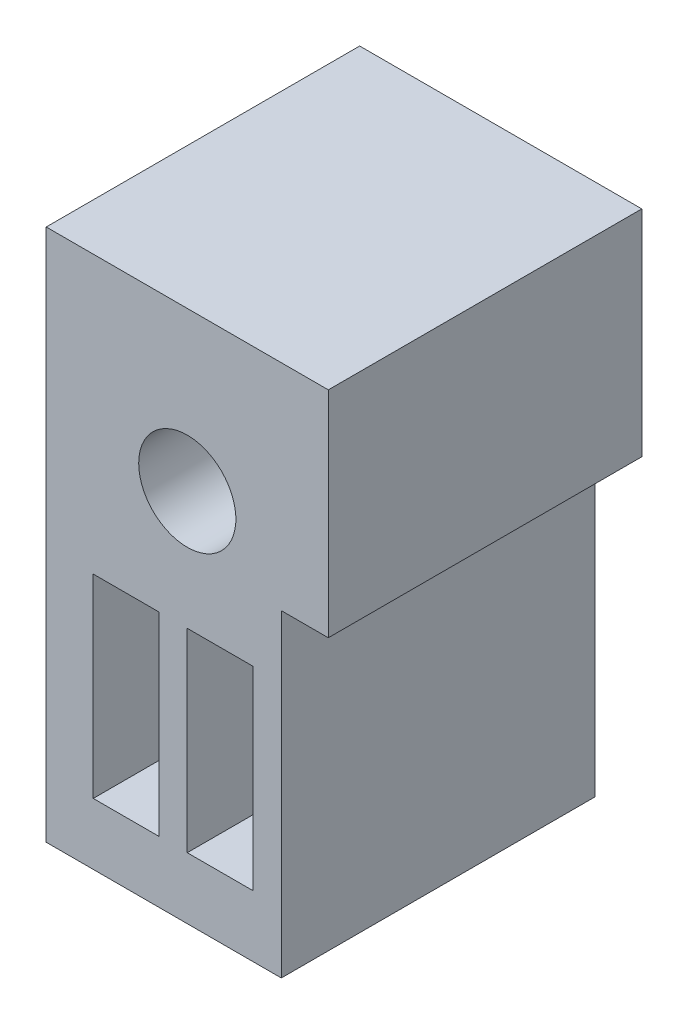
ISO-10303-21;
HEADER;
FILE_DESCRIPTION(('STEP AP214'),'2;1');
FILE_NAME('part.step','',(''),(''),'','','');
FILE_SCHEMA(('AUTOMOTIVE_DESIGN { 1 0 10303 214 1 1 1 1 }'));
ENDSEC;
DATA;
#1=APPLICATION_CONTEXT('core data for automotive mechanical design processes');
#2=APPLICATION_PROTOCOL_DEFINITION('international standard','automotive_design',2000,#1);
#3=PRODUCT_CONTEXT('',#1,'mechanical');
#4=PRODUCT('Part','Part','',(#3));
#5=PRODUCT_RELATED_PRODUCT_CATEGORY('part','',(#4));
#6=PRODUCT_DEFINITION_FORMATION('','',#4);
#7=PRODUCT_DEFINITION_CONTEXT('part definition',#1,'design');
#8=PRODUCT_DEFINITION('design','',#6,#7);
#9=PRODUCT_DEFINITION_SHAPE('','',#8);
#10=(LENGTH_UNIT() NAMED_UNIT(*) SI_UNIT(.MILLI.,.METRE.));
#11=(NAMED_UNIT(*) PLANE_ANGLE_UNIT() SI_UNIT($,.RADIAN.));
#12=(NAMED_UNIT(*) SI_UNIT($,.STERADIAN.) SOLID_ANGLE_UNIT());
#13=UNCERTAINTY_MEASURE_WITH_UNIT(LENGTH_MEASURE(1.E-05),#10,'distance_accuracy_value','');
#14=(GEOMETRIC_REPRESENTATION_CONTEXT(3) GLOBAL_UNCERTAINTY_ASSIGNED_CONTEXT((#13)) GLOBAL_UNIT_ASSIGNED_CONTEXT((#10,
#11,#12)) REPRESENTATION_CONTEXT('',''));
#15=CARTESIAN_POINT('',(0.,0.,0.));
#16=DIRECTION('',(0.,0.,1.));
#17=DIRECTION('',(1.,0.,0.));
#18=AXIS2_PLACEMENT_3D('',#15,#16,#17);
#19=CARTESIAN_POINT('',(0.,0.,-30.1695073311752));
#20=DIRECTION('',(0.,0.,1.));
#21=DIRECTION('',(1.,0.,0.));
#22=AXIS2_PLACEMENT_3D('',#19,#20,#21);
#23=PLANE('',#22);
#24=DIRECTION('',(0.,-1.,0.));
#25=VECTOR('',#24,1.);
#26=CARTESIAN_POINT('',(18.2480610316519,23.3882221671382,-30.1695073311752));
#27=LINE('',#26,#25);
#28=CARTESIAN_POINT('',(18.2480610316519,23.3882221671382,-30.1695073311752));
#29=VERTEX_POINT('',#28);
#30=CARTESIAN_POINT('',(18.2480610316519,17.1882221671382,-30.1695073311752));
#31=VERTEX_POINT('',#30);
#32=EDGE_CURVE('E167',#29,#31,#27,.T.);
#33=ORIENTED_EDGE('',*,*,#32,.F.);
#34=DIRECTION('',(1.,0.,0.));
#35=VECTOR('',#34,1.);
#36=CARTESIAN_POINT('',(16.1480610316519,23.3882221671382,-30.1695073311752));
#37=LINE('',#36,#35);
#38=CARTESIAN_POINT('',(16.1480610316519,23.3882221671382,-30.1695073311752));
#39=VERTEX_POINT('',#38);
#40=EDGE_CURVE('E175',#39,#29,#37,.T.);
#41=ORIENTED_EDGE('',*,*,#40,.F.);
#42=DIRECTION('',(0.,1.,0.));
#43=VECTOR('',#42,1.);
#44=CARTESIAN_POINT('',(16.1480610316519,23.3882221671382,-30.1695073311752));
#45=LINE('',#44,#43);
#46=CARTESIAN_POINT('',(16.1480610316519,17.1882221671382,-30.1695073311752));
#47=VERTEX_POINT('',#46);
#48=EDGE_CURVE('E172',#47,#39,#45,.T.);
#49=ORIENTED_EDGE('',*,*,#48,.F.);
#50=DIRECTION('',(-1.,0.,0.));
#51=VECTOR('',#50,1.);
#52=CARTESIAN_POINT('',(18.2480610316519,17.1882221671382,-30.1695073311752));
#53=LINE('',#52,#51);
#54=EDGE_CURVE('E169',#31,#47,#53,.T.);
#55=ORIENTED_EDGE('',*,*,#54,.F.);
#56=EDGE_LOOP('',(#33,#41,#49,#55));
#57=FACE_BOUND('',#56,.T.);
#58=DIRECTION('',(1.,0.,0.));
#59=VECTOR('',#58,1.);
#60=CARTESIAN_POINT('',(19.1480610316519,32.2269800340669,-30.1695073311752));
#61=LINE('',#60,#59);
#62=CARTESIAN_POINT('',(14.6480610316519,32.2269800340669,-30.1695073311752));
#63=VERTEX_POINT('',#62);
#64=CARTESIAN_POINT('',(23.6480610316519,32.2269800340669,-30.1695073311752));
#65=VERTEX_POINT('',#64);
#66=EDGE_CURVE('E204',#63,#65,#61,.T.);
#67=ORIENTED_EDGE('',*,*,#66,.T.);
#68=DIRECTION('',(0.,-1.,0.));
#69=VECTOR('',#68,1.);
#70=CARTESIAN_POINT('',(23.6480610316519,32.2269800340669,-30.1695073311752));
#71=LINE('',#70,#69);
#72=CARTESIAN_POINT('',(23.6480610316519,25.3772167345225,-30.1695073311752));
#73=VERTEX_POINT('',#72);
#74=EDGE_CURVE('E206',#65,#73,#71,.T.);
#75=ORIENTED_EDGE('',*,*,#74,.T.);
#76=DIRECTION('',(-1.,0.,0.));
#77=VECTOR('',#76,1.);
#78=CARTESIAN_POINT('',(23.6480610316519,25.3772167345225,-30.1695073311752));
#79=LINE('',#78,#77);
#80=CARTESIAN_POINT('',(22.1480610316519,25.3772167345225,-30.1695073311752));
#81=VERTEX_POINT('',#80);
#82=EDGE_CURVE('E209',#73,#81,#79,.T.);
#83=ORIENTED_EDGE('',*,*,#82,.T.);
#84=DIRECTION('',(0.,-1.,0.));
#85=VECTOR('',#84,1.);
#86=CARTESIAN_POINT('',(22.1480610316519,25.3772167345225,-30.1695073311752));
#87=LINE('',#86,#85);
#88=CARTESIAN_POINT('',(22.1480610316519,15.2269800340722,-30.1695073311752));
#89=VERTEX_POINT('',#88);
#90=EDGE_CURVE('E211',#81,#89,#87,.T.);
#91=ORIENTED_EDGE('',*,*,#90,.T.);
#92=DIRECTION('',(-1.,0.,0.));
#93=VECTOR('',#92,1.);
#94=CARTESIAN_POINT('',(22.1480610316519,15.2269800340722,-30.1695073311752));
#95=LINE('',#94,#93);
#96=CARTESIAN_POINT('',(14.6480610316519,15.226980034072,-30.1695073311752));
#97=VERTEX_POINT('',#96);
#98=EDGE_CURVE('E213',#89,#97,#95,.T.);
#99=ORIENTED_EDGE('',*,*,#98,.T.);
#100=DIRECTION('',(0.,1.,0.));
#101=VECTOR('',#100,1.);
#102=CARTESIAN_POINT('',(14.6480610316519,25.377216734525,-30.1695073311752));
#103=LINE('',#102,#101);
#104=EDGE_CURVE('E215',#97,#63,#103,.T.);
#105=ORIENTED_EDGE('',*,*,#104,.T.);
#106=EDGE_LOOP('',(#67,#75,#83,#91,#99,#105));
#107=FACE_BOUND('',#106,.T.);
#108=CARTESIAN_POINT('',(19.1480610316519,27.1767433336178,-30.1695073311752));
#109=DIRECTION('',(0.,0.,-1.));
#110=DIRECTION('',(-1.,0.,0.));
#111=AXIS2_PLACEMENT_3D('',#108,#109,#110);
#112=CIRCLE('',#111,1.55000000000021);
#113=CARTESIAN_POINT('',(17.5980610316517,27.1767433336178,-30.1695073311752));
#114=VERTEX_POINT('',#113);
#115=EDGE_CURVE('E198',#114,#114,#112,.T.);
#116=ORIENTED_EDGE('',*,*,#115,.F.);
#117=EDGE_LOOP('',(#116));
#118=FACE_BOUND('',#117,.T.);
#119=DIRECTION('',(-1.,0.,0.));
#120=VECTOR('',#119,1.);
#121=CARTESIAN_POINT('',(21.2469833029343,17.1882221671376,-30.1695073311752));
#122=LINE('',#121,#120);
#123=CARTESIAN_POINT('',(21.2469833029343,17.1882221671376,-30.1695073311752));
#124=VERTEX_POINT('',#123);
#125=CARTESIAN_POINT('',(19.1469833029342,17.1882221671376,-30.1695073311752));
#126=VERTEX_POINT('',#125);
#127=EDGE_CURVE('E131',#124,#126,#122,.T.);
#128=ORIENTED_EDGE('',*,*,#127,.F.);
#129=DIRECTION('',(0.,-1.,0.));
#130=VECTOR('',#129,1.);
#131=CARTESIAN_POINT('',(21.2469833029343,23.3882221671376,-30.1695073311752));
#132=LINE('',#131,#130);
#133=CARTESIAN_POINT('',(21.2469833029343,23.3882221671376,-30.1695073311752));
#134=VERTEX_POINT('',#133);
#135=EDGE_CURVE('E153',#134,#124,#132,.T.);
#136=ORIENTED_EDGE('',*,*,#135,.F.);
#137=DIRECTION('',(1.,0.,0.));
#138=VECTOR('',#137,1.);
#139=CARTESIAN_POINT('',(19.1469833029342,23.3882221671376,-30.1695073311752));
#140=LINE('',#139,#138);
#141=CARTESIAN_POINT('',(19.1469833029342,23.3882221671376,-30.1695073311752));
#142=VERTEX_POINT('',#141);
#143=EDGE_CURVE('E151',#142,#134,#140,.T.);
#144=ORIENTED_EDGE('',*,*,#143,.F.);
#145=DIRECTION('',(0.,1.,0.));
#146=VECTOR('',#145,1.);
#147=CARTESIAN_POINT('',(19.1469833029342,17.1882221671376,-30.1695073311752));
#148=LINE('',#147,#146);
#149=EDGE_CURVE('E139',#126,#142,#148,.T.);
#150=ORIENTED_EDGE('',*,*,#149,.F.);
#151=EDGE_LOOP('',(#128,#136,#144,#150));
#152=FACE_BOUND('',#151,.T.);
#153=ADVANCED_FACE('F30',(#57,#107,#118,#152),#23,.F.);
#154=CARTESIAN_POINT('',(0.,0.,-20.1695073311752));
#155=DIRECTION('',(0.,0.,1.));
#156=DIRECTION('',(1.,0.,0.));
#157=AXIS2_PLACEMENT_3D('',#154,#155,#156);
#158=PLANE('',#157);
#159=DIRECTION('',(1.,0.,0.));
#160=VECTOR('',#159,1.);
#161=CARTESIAN_POINT('',(16.1480610316519,23.3882221671382,-20.1695073311752));
#162=LINE('',#161,#160);
#163=CARTESIAN_POINT('',(16.1480610316519,23.3882221671382,-20.1695073311752));
#164=VERTEX_POINT('',#163);
#165=CARTESIAN_POINT('',(18.2480610316519,23.3882221671382,-20.1695073311752));
#166=VERTEX_POINT('',#165);
#167=EDGE_CURVE('E170',#164,#166,#162,.T.);
#168=ORIENTED_EDGE('',*,*,#167,.T.);
#169=DIRECTION('',(0.,-1.,0.));
#170=VECTOR('',#169,1.);
#171=CARTESIAN_POINT('',(18.2480610316519,23.3882221671382,-20.1695073311752));
#172=LINE('',#171,#170);
#173=CARTESIAN_POINT('',(18.2480610316519,17.1882221671382,-20.1695073311752));
#174=VERTEX_POINT('',#173);
#175=EDGE_CURVE('E147',#166,#174,#172,.T.);
#176=ORIENTED_EDGE('',*,*,#175,.T.);
#177=DIRECTION('',(-1.,0.,0.));
#178=VECTOR('',#177,1.);
#179=CARTESIAN_POINT('',(18.2480610316519,17.1882221671382,-20.1695073311752));
#180=LINE('',#179,#178);
#181=CARTESIAN_POINT('',(16.1480610316519,17.1882221671382,-20.1695073311752));
#182=VERTEX_POINT('',#181);
#183=EDGE_CURVE('E180',#174,#182,#180,.T.);
#184=ORIENTED_EDGE('',*,*,#183,.T.);
#185=DIRECTION('',(0.,1.,0.));
#186=VECTOR('',#185,1.);
#187=CARTESIAN_POINT('',(16.1480610316519,23.3882221671382,-20.1695073311752));
#188=LINE('',#187,#186);
#189=EDGE_CURVE('E183',#182,#164,#188,.T.);
#190=ORIENTED_EDGE('',*,*,#189,.T.);
#191=EDGE_LOOP('',(#168,#176,#184,#190));
#192=FACE_BOUND('',#191,.T.);
#193=DIRECTION('',(1.,0.,0.));
#194=VECTOR('',#193,1.);
#195=CARTESIAN_POINT('',(19.1480610316519,32.2269800340669,-20.1695073311752));
#196=LINE('',#195,#194);
#197=CARTESIAN_POINT('',(14.6480610316519,32.2269800340669,-20.1695073311752));
#198=VERTEX_POINT('',#197);
#199=CARTESIAN_POINT('',(23.6480610316519,32.2269800340669,-20.1695073311752));
#200=VERTEX_POINT('',#199);
#201=EDGE_CURVE('E201',#198,#200,#196,.T.);
#202=ORIENTED_EDGE('',*,*,#201,.F.);
#203=DIRECTION('',(0.,1.,0.));
#204=VECTOR('',#203,1.);
#205=CARTESIAN_POINT('',(14.6480610316519,32.2269800340669,-20.1695073311752));
#206=LINE('',#205,#204);
#207=CARTESIAN_POINT('',(14.6480610316519,15.226980034072,-20.1695073311752));
#208=VERTEX_POINT('',#207);
#209=EDGE_CURVE('E207',#208,#198,#206,.T.);
#210=ORIENTED_EDGE('',*,*,#209,.F.);
#211=DIRECTION('',(-1.,0.,0.));
#212=VECTOR('',#211,1.);
#213=CARTESIAN_POINT('',(14.6480610316519,15.226980034072,-20.1695073311752));
#214=LINE('',#213,#212);
#215=CARTESIAN_POINT('',(22.1480610316519,15.2269800340722,-20.1695073311752));
#216=VERTEX_POINT('',#215);
#217=EDGE_CURVE('E226',#216,#208,#214,.T.);
#218=ORIENTED_EDGE('',*,*,#217,.F.);
#219=DIRECTION('',(0.,-1.,0.));
#220=VECTOR('',#219,1.);
#221=CARTESIAN_POINT('',(22.1480610316519,25.3772167345225,-20.1695073311752));
#222=LINE('',#221,#220);
#223=CARTESIAN_POINT('',(22.1480610316519,25.3772167345225,-20.1695073311752));
#224=VERTEX_POINT('',#223);
#225=EDGE_CURVE('E223',#224,#216,#222,.T.);
#226=ORIENTED_EDGE('',*,*,#225,.F.);
#227=DIRECTION('',(-1.,0.,0.));
#228=VECTOR('',#227,1.);
#229=CARTESIAN_POINT('',(23.6480610316519,25.3772167345225,-20.1695073311752));
#230=LINE('',#229,#228);
#231=CARTESIAN_POINT('',(23.6480610316519,25.3772167345225,-20.1695073311752));
#232=VERTEX_POINT('',#231);
#233=EDGE_CURVE('E221',#232,#224,#230,.T.);
#234=ORIENTED_EDGE('',*,*,#233,.F.);
#235=DIRECTION('',(0.,-1.,0.));
#236=VECTOR('',#235,1.);
#237=CARTESIAN_POINT('',(23.6480610316519,32.2269800340669,-20.1695073311752));
#238=LINE('',#237,#236);
#239=EDGE_CURVE('E219',#200,#232,#238,.T.);
#240=ORIENTED_EDGE('',*,*,#239,.F.);
#241=EDGE_LOOP('',(#202,#210,#218,#226,#234,#240));
#242=FACE_BOUND('',#241,.T.);
#243=CARTESIAN_POINT('',(19.1480610316519,27.1767433336178,-20.1695073311752));
#244=DIRECTION('',(0.,0.,-1.));
#245=DIRECTION('',(-1.,0.,0.));
#246=AXIS2_PLACEMENT_3D('',#243,#244,#245);
#247=CIRCLE('',#246,1.55000000000021);
#248=CARTESIAN_POINT('',(17.5980610316517,27.1767433336178,-20.1695073311752));
#249=VERTEX_POINT('',#248);
#250=EDGE_CURVE('E197',#249,#249,#247,.T.);
#251=ORIENTED_EDGE('',*,*,#250,.T.);
#252=EDGE_LOOP('',(#251));
#253=FACE_BOUND('',#252,.T.);
#254=DIRECTION('',(0.,-1.,0.));
#255=VECTOR('',#254,1.);
#256=CARTESIAN_POINT('',(21.2469833029343,23.3882221671376,-20.1695073311752));
#257=LINE('',#256,#255);
#258=CARTESIAN_POINT('',(21.2469833029343,23.3882221671376,-20.1695073311752));
#259=VERTEX_POINT('',#258);
#260=CARTESIAN_POINT('',(21.2469833029343,17.1882221671376,-20.1695073311752));
#261=VERTEX_POINT('',#260);
#262=EDGE_CURVE('E140',#259,#261,#257,.T.);
#263=ORIENTED_EDGE('',*,*,#262,.T.);
#264=DIRECTION('',(-1.,0.,0.));
#265=VECTOR('',#264,1.);
#266=CARTESIAN_POINT('',(21.2469833029343,17.1882221671376,-20.1695073311752));
#267=LINE('',#266,#265);
#268=CARTESIAN_POINT('',(19.1469833029342,17.1882221671376,-20.1695073311752));
#269=VERTEX_POINT('',#268);
#270=EDGE_CURVE('E53',#261,#269,#267,.T.);
#271=ORIENTED_EDGE('',*,*,#270,.T.);
#272=DIRECTION('',(0.,1.,0.));
#273=VECTOR('',#272,1.);
#274=CARTESIAN_POINT('',(19.1469833029342,17.1882221671376,-20.1695073311752));
#275=LINE('',#274,#273);
#276=CARTESIAN_POINT('',(19.1469833029342,23.3882221671376,-20.1695073311752));
#277=VERTEX_POINT('',#276);
#278=EDGE_CURVE('E146',#269,#277,#275,.T.);
#279=ORIENTED_EDGE('',*,*,#278,.T.);
#280=DIRECTION('',(1.,0.,0.));
#281=VECTOR('',#280,1.);
#282=CARTESIAN_POINT('',(19.1469833029342,23.3882221671376,-20.1695073311752));
#283=LINE('',#282,#281);
#284=EDGE_CURVE('E159',#277,#259,#283,.T.);
#285=ORIENTED_EDGE('',*,*,#284,.T.);
#286=EDGE_LOOP('',(#263,#271,#279,#285));
#287=FACE_BOUND('',#286,.T.);
#288=ADVANCED_FACE('F253',(#192,#242,#253,#287),#158,.T.);
#289=CARTESIAN_POINT('',(19.1480610316519,32.2269800340669,-30.1695073311752));
#290=DIRECTION('',(0.,-1.,0.));
#291=DIRECTION('',(0.,0.,-1.));
#292=AXIS2_PLACEMENT_3D('',#289,#290,#291);
#293=PLANE('',#292);
#294=ORIENTED_EDGE('',*,*,#201,.T.);
#295=DIRECTION('',(0.,0.,1.));
#296=VECTOR('',#295,1.);
#297=CARTESIAN_POINT('',(23.6480610316519,32.2269800340669,-30.1695073311752));
#298=LINE('',#297,#296);
#299=EDGE_CURVE('E11',#65,#200,#298,.T.);
#300=ORIENTED_EDGE('',*,*,#299,.F.);
#301=ORIENTED_EDGE('',*,*,#66,.F.);
#302=DIRECTION('',(0.,0.,1.));
#303=VECTOR('',#302,1.);
#304=CARTESIAN_POINT('',(14.6480610316519,32.2269800340669,-30.1695073311752));
#305=LINE('',#304,#303);
#306=EDGE_CURVE('E217',#63,#198,#305,.T.);
#307=ORIENTED_EDGE('',*,*,#306,.T.);
#308=EDGE_LOOP('',(#294,#300,#301,#307));
#309=FACE_BOUND('',#308,.T.);
#310=ADVANCED_FACE('F32',(#309),#293,.F.);
#311=CARTESIAN_POINT('',(23.6480610316519,32.2269800340669,-30.1695073311752));
#312=DIRECTION('',(-1.,0.,0.));
#313=DIRECTION('',(0.,0.,1.));
#314=AXIS2_PLACEMENT_3D('',#311,#312,#313);
#315=PLANE('',#314);
#316=ORIENTED_EDGE('',*,*,#239,.T.);
#317=DIRECTION('',(0.,0.,1.));
#318=VECTOR('',#317,1.);
#319=CARTESIAN_POINT('',(23.6480610316519,25.3772167345225,-30.1695073311752));
#320=LINE('',#319,#318);
#321=EDGE_CURVE('E38',#73,#232,#320,.T.);
#322=ORIENTED_EDGE('',*,*,#321,.F.);
#323=ORIENTED_EDGE('',*,*,#74,.F.);
#324=ORIENTED_EDGE('',*,*,#299,.T.);
#325=EDGE_LOOP('',(#316,#322,#323,#324));
#326=FACE_BOUND('',#325,.T.);
#327=ADVANCED_FACE('F269',(#326),#315,.F.);
#328=CARTESIAN_POINT('',(23.6480610316519,25.3772167345225,-30.1695073311752));
#329=DIRECTION('',(0.,1.,0.));
#330=DIRECTION('',(0.,0.,1.));
#331=AXIS2_PLACEMENT_3D('',#328,#329,#330);
#332=PLANE('',#331);
#333=ORIENTED_EDGE('',*,*,#233,.T.);
#334=DIRECTION('',(0.,0.,1.));
#335=VECTOR('',#334,1.);
#336=CARTESIAN_POINT('',(22.1480610316519,25.3772167345225,-30.1695073311752));
#337=LINE('',#336,#335);
#338=EDGE_CURVE('E239',#81,#224,#337,.T.);
#339=ORIENTED_EDGE('',*,*,#338,.F.);
#340=ORIENTED_EDGE('',*,*,#82,.F.);
#341=ORIENTED_EDGE('',*,*,#321,.T.);
#342=EDGE_LOOP('',(#333,#339,#340,#341));
#343=FACE_BOUND('',#342,.T.);
#344=ADVANCED_FACE('F246',(#343),#332,.F.);
#345=CARTESIAN_POINT('',(22.1480610316519,25.3772167345225,-30.1695073311752));
#346=DIRECTION('',(-1.,0.,0.));
#347=DIRECTION('',(0.,0.,1.));
#348=AXIS2_PLACEMENT_3D('',#345,#346,#347);
#349=PLANE('',#348);
#350=ORIENTED_EDGE('',*,*,#225,.T.);
#351=DIRECTION('',(0.,0.,1.));
#352=VECTOR('',#351,1.);
#353=CARTESIAN_POINT('',(22.1480610316519,15.2269800340722,-30.1695073311752));
#354=LINE('',#353,#352);
#355=EDGE_CURVE('E236',#89,#216,#354,.T.);
#356=ORIENTED_EDGE('',*,*,#355,.F.);
#357=ORIENTED_EDGE('',*,*,#90,.F.);
#358=ORIENTED_EDGE('',*,*,#338,.T.);
#359=EDGE_LOOP('',(#350,#356,#357,#358));
#360=FACE_BOUND('',#359,.T.);
#361=ADVANCED_FACE('F257',(#360),#349,.F.);
#362=CARTESIAN_POINT('',(14.6480610316519,15.226980034072,-30.1695073311752));
#363=DIRECTION('',(0.,1.,0.));
#364=DIRECTION('',(0.,0.,1.));
#365=AXIS2_PLACEMENT_3D('',#362,#363,#364);
#366=PLANE('',#365);
#367=ORIENTED_EDGE('',*,*,#217,.T.);
#368=DIRECTION('',(0.,0.,1.));
#369=VECTOR('',#368,1.);
#370=CARTESIAN_POINT('',(14.6480610316519,15.226980034072,-30.1695073311752));
#371=LINE('',#370,#369);
#372=EDGE_CURVE('E233',#97,#208,#371,.T.);
#373=ORIENTED_EDGE('',*,*,#372,.F.);
#374=ORIENTED_EDGE('',*,*,#98,.F.);
#375=ORIENTED_EDGE('',*,*,#355,.T.);
#376=EDGE_LOOP('',(#367,#373,#374,#375));
#377=FACE_BOUND('',#376,.T.);
#378=ADVANCED_FACE('F261',(#377),#366,.F.);
#379=CARTESIAN_POINT('',(14.6480610316519,32.2269800340669,-30.1695073311752));
#380=DIRECTION('',(1.,0.,0.));
#381=DIRECTION('',(0.,0.,-1.));
#382=AXIS2_PLACEMENT_3D('',#379,#380,#381);
#383=PLANE('',#382);
#384=ORIENTED_EDGE('',*,*,#209,.T.);
#385=ORIENTED_EDGE('',*,*,#306,.F.);
#386=ORIENTED_EDGE('',*,*,#104,.F.);
#387=ORIENTED_EDGE('',*,*,#372,.T.);
#388=EDGE_LOOP('',(#384,#385,#386,#387));
#389=FACE_BOUND('',#388,.T.);
#390=ADVANCED_FACE('F272',(#389),#383,.F.);
#391=CARTESIAN_POINT('',(19.1480610316519,27.1767433336178,-30.1695073311752));
#392=DIRECTION('',(0.,0.,1.));
#393=DIRECTION('',(1.,0.,0.));
#394=AXIS2_PLACEMENT_3D('',#391,#392,#393);
#395=CYLINDRICAL_SURFACE('',#394,1.55000000000021);
#396=ORIENTED_EDGE('',*,*,#115,.T.);
#397=EDGE_LOOP('',(#396));
#398=FACE_BOUND('',#397,.T.);
#399=ORIENTED_EDGE('',*,*,#250,.F.);
#400=EDGE_LOOP('',(#399));
#401=FACE_BOUND('',#400,.T.);
#402=ADVANCED_FACE('F274',(#398,#401),#395,.F.);
#403=CARTESIAN_POINT('',(18.2480610316519,23.3882221671382,-30.1695073311752));
#404=DIRECTION('',(-1.,0.,0.));
#405=DIRECTION('',(0.,0.,1.));
#406=AXIS2_PLACEMENT_3D('',#403,#404,#405);
#407=PLANE('',#406);
#408=ORIENTED_EDGE('',*,*,#175,.F.);
#409=DIRECTION('',(0.,0.,1.));
#410=VECTOR('',#409,1.);
#411=CARTESIAN_POINT('',(18.2480610316519,23.3882221671382,-30.1695073311752));
#412=LINE('',#411,#410);
#413=EDGE_CURVE('E177',#29,#166,#412,.T.);
#414=ORIENTED_EDGE('',*,*,#413,.F.);
#415=ORIENTED_EDGE('',*,*,#32,.T.);
#416=DIRECTION('',(0.,0.,1.));
#417=VECTOR('',#416,1.);
#418=CARTESIAN_POINT('',(18.2480610316519,17.1882221671382,-30.1695073311752));
#419=LINE('',#418,#417);
#420=EDGE_CURVE('E194',#31,#174,#419,.T.);
#421=ORIENTED_EDGE('',*,*,#420,.T.);
#422=EDGE_LOOP('',(#408,#414,#415,#421));
#423=FACE_BOUND('',#422,.T.);
#424=ADVANCED_FACE('F280',(#423),#407,.T.);
#425=CARTESIAN_POINT('',(18.2480610316519,17.1882221671382,-30.1695073311752));
#426=DIRECTION('',(0.,1.,0.));
#427=DIRECTION('',(0.,0.,1.));
#428=AXIS2_PLACEMENT_3D('',#425,#426,#427);
#429=PLANE('',#428);
#430=ORIENTED_EDGE('',*,*,#183,.F.);
#431=ORIENTED_EDGE('',*,*,#420,.F.);
#432=ORIENTED_EDGE('',*,*,#54,.T.);
#433=DIRECTION('',(0.,0.,1.));
#434=VECTOR('',#433,1.);
#435=CARTESIAN_POINT('',(16.1480610316519,17.1882221671382,-30.1695073311752));
#436=LINE('',#435,#434);
#437=EDGE_CURVE('E192',#47,#182,#436,.T.);
#438=ORIENTED_EDGE('',*,*,#437,.T.);
#439=EDGE_LOOP('',(#430,#431,#432,#438));
#440=FACE_BOUND('',#439,.T.);
#441=ADVANCED_FACE('F296',(#440),#429,.T.);
#442=CARTESIAN_POINT('',(16.1480610316519,23.3882221671382,-30.1695073311752));
#443=DIRECTION('',(1.,0.,0.));
#444=DIRECTION('',(0.,0.,-1.));
#445=AXIS2_PLACEMENT_3D('',#442,#443,#444);
#446=PLANE('',#445);
#447=ORIENTED_EDGE('',*,*,#189,.F.);
#448=ORIENTED_EDGE('',*,*,#437,.F.);
#449=ORIENTED_EDGE('',*,*,#48,.T.);
#450=DIRECTION('',(0.,0.,1.));
#451=VECTOR('',#450,1.);
#452=CARTESIAN_POINT('',(16.1480610316519,23.3882221671382,-30.1695073311752));
#453=LINE('',#452,#451);
#454=EDGE_CURVE('E190',#39,#164,#453,.T.);
#455=ORIENTED_EDGE('',*,*,#454,.T.);
#456=EDGE_LOOP('',(#447,#448,#449,#455));
#457=FACE_BOUND('',#456,.T.);
#458=ADVANCED_FACE('F300',(#457),#446,.T.);
#459=CARTESIAN_POINT('',(16.1480610316519,23.3882221671382,-30.1695073311752));
#460=DIRECTION('',(0.,-1.,0.));
#461=DIRECTION('',(0.,0.,-1.));
#462=AXIS2_PLACEMENT_3D('',#459,#460,#461);
#463=PLANE('',#462);
#464=ORIENTED_EDGE('',*,*,#167,.F.);
#465=ORIENTED_EDGE('',*,*,#454,.F.);
#466=ORIENTED_EDGE('',*,*,#40,.T.);
#467=ORIENTED_EDGE('',*,*,#413,.T.);
#468=EDGE_LOOP('',(#464,#465,#466,#467));
#469=FACE_BOUND('',#468,.T.);
#470=ADVANCED_FACE('F304',(#469),#463,.T.);
#471=CARTESIAN_POINT('',(21.2469833029343,17.1882221671376,-30.1695073311752));
#472=DIRECTION('',(0.,1.,0.));
#473=DIRECTION('',(0.,0.,1.));
#474=AXIS2_PLACEMENT_3D('',#471,#472,#473);
#475=PLANE('',#474);
#476=ORIENTED_EDGE('',*,*,#270,.F.);
#477=DIRECTION('',(0.,0.,1.));
#478=VECTOR('',#477,1.);
#479=CARTESIAN_POINT('',(21.2469833029343,17.1882221671376,-30.1695073311752));
#480=LINE('',#479,#478);
#481=EDGE_CURVE('E135',#124,#261,#480,.T.);
#482=ORIENTED_EDGE('',*,*,#481,.F.);
#483=ORIENTED_EDGE('',*,*,#127,.T.);
#484=DIRECTION('',(0.,0.,1.));
#485=VECTOR('',#484,1.);
#486=CARTESIAN_POINT('',(19.1469833029342,17.1882221671376,-30.1695073311752));
#487=LINE('',#486,#485);
#488=EDGE_CURVE('E134',#126,#269,#487,.T.);
#489=ORIENTED_EDGE('',*,*,#488,.T.);
#490=EDGE_LOOP('',(#476,#482,#483,#489));
#491=FACE_BOUND('',#490,.T.);
#492=ADVANCED_FACE('F133',(#491),#475,.T.);
#493=CARTESIAN_POINT('',(19.1469833029342,17.1882221671376,-30.1695073311752));
#494=DIRECTION('',(1.,0.,0.));
#495=DIRECTION('',(0.,0.,-1.));
#496=AXIS2_PLACEMENT_3D('',#493,#494,#495);
#497=PLANE('',#496);
#498=ORIENTED_EDGE('',*,*,#278,.F.);
#499=ORIENTED_EDGE('',*,*,#488,.F.);
#500=ORIENTED_EDGE('',*,*,#149,.T.);
#501=DIRECTION('',(0.,0.,1.));
#502=VECTOR('',#501,1.);
#503=CARTESIAN_POINT('',(19.1469833029342,23.3882221671376,-30.1695073311752));
#504=LINE('',#503,#502);
#505=EDGE_CURVE('E148',#142,#277,#504,.T.);
#506=ORIENTED_EDGE('',*,*,#505,.T.);
#507=EDGE_LOOP('',(#498,#499,#500,#506));
#508=FACE_BOUND('',#507,.T.);
#509=ADVANCED_FACE('F143',(#508),#497,.T.);
#510=CARTESIAN_POINT('',(19.1469833029342,23.3882221671376,-30.1695073311752));
#511=DIRECTION('',(0.,-1.,0.));
#512=DIRECTION('',(0.,0.,-1.));
#513=AXIS2_PLACEMENT_3D('',#510,#511,#512);
#514=PLANE('',#513);
#515=ORIENTED_EDGE('',*,*,#284,.F.);
#516=ORIENTED_EDGE('',*,*,#505,.F.);
#517=ORIENTED_EDGE('',*,*,#143,.T.);
#518=DIRECTION('',(0.,0.,1.));
#519=VECTOR('',#518,1.);
#520=CARTESIAN_POINT('',(21.2469833029343,23.3882221671376,-30.1695073311752));
#521=LINE('',#520,#519);
#522=EDGE_CURVE('E45',#134,#259,#521,.T.);
#523=ORIENTED_EDGE('',*,*,#522,.T.);
#524=EDGE_LOOP('',(#515,#516,#517,#523));
#525=FACE_BOUND('',#524,.T.);
#526=ADVANCED_FACE('F313',(#525),#514,.T.);
#527=CARTESIAN_POINT('',(21.2469833029343,23.3882221671376,-30.1695073311752));
#528=DIRECTION('',(-1.,0.,0.));
#529=DIRECTION('',(0.,0.,1.));
#530=AXIS2_PLACEMENT_3D('',#527,#528,#529);
#531=PLANE('',#530);
#532=ORIENTED_EDGE('',*,*,#262,.F.);
#533=ORIENTED_EDGE('',*,*,#522,.F.);
#534=ORIENTED_EDGE('',*,*,#135,.T.);
#535=ORIENTED_EDGE('',*,*,#481,.T.);
#536=EDGE_LOOP('',(#532,#533,#534,#535));
#537=FACE_BOUND('',#536,.T.);
#538=ADVANCED_FACE('F316',(#537),#531,.T.);
#539=CLOSED_SHELL('',(#153,#288,#310,#327,#344,#361,#378,#390,#402,#424,#441,#458,#470,#492,
#509,#526,#538));
#540=MANIFOLD_SOLID_BREP('B2',#539);
#541=ADVANCED_BREP_SHAPE_REPRESENTATION('',(#18,#540),#14);
#542=SHAPE_DEFINITION_REPRESENTATION(#9,#541);
ENDSEC;
END-ISO-10303-21;
